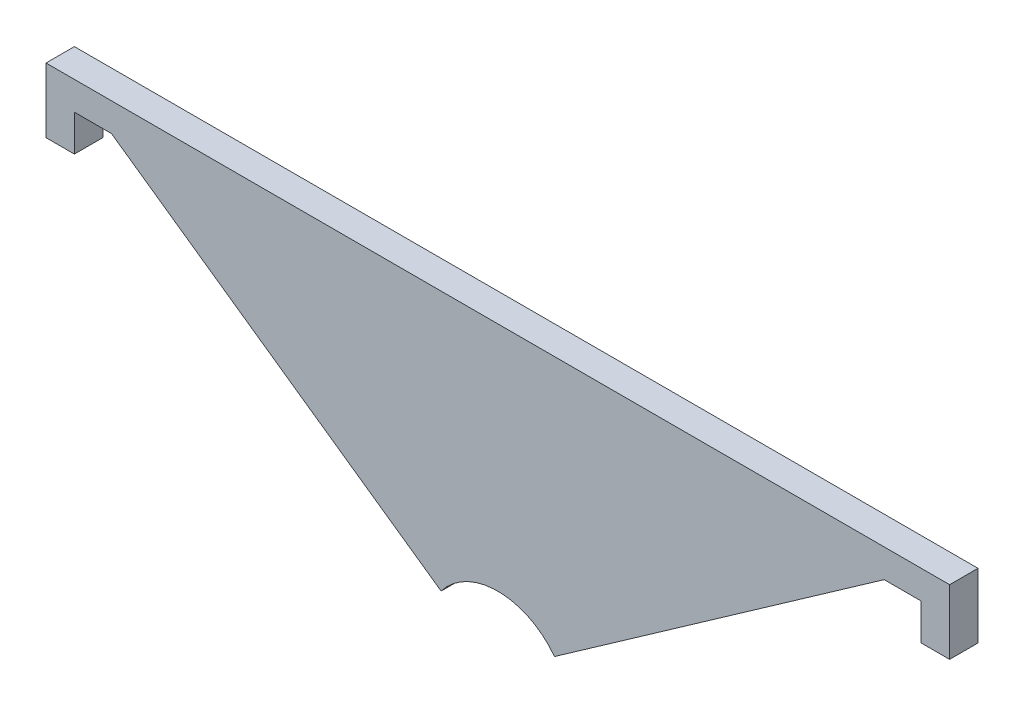
ISO-10303-21;
HEADER;
FILE_DESCRIPTION(('STEP AP214'),'2;1');
FILE_NAME('part.step','',(''),(''),'','','');
FILE_SCHEMA(('AUTOMOTIVE_DESIGN { 1 0 10303 214 1 1 1 1 }'));
ENDSEC;
DATA;
#1=APPLICATION_CONTEXT('core data for automotive mechanical design processes');
#2=APPLICATION_PROTOCOL_DEFINITION('international standard','automotive_design',2000,#1);
#3=PRODUCT_CONTEXT('',#1,'mechanical');
#4=PRODUCT('Part','Part','',(#3));
#5=PRODUCT_RELATED_PRODUCT_CATEGORY('part','',(#4));
#6=PRODUCT_DEFINITION_FORMATION('','',#4);
#7=PRODUCT_DEFINITION_CONTEXT('part definition',#1,'design');
#8=PRODUCT_DEFINITION('design','',#6,#7);
#9=PRODUCT_DEFINITION_SHAPE('','',#8);
#10=(LENGTH_UNIT() NAMED_UNIT(*) SI_UNIT(.MILLI.,.METRE.));
#11=(NAMED_UNIT(*) PLANE_ANGLE_UNIT() SI_UNIT($,.RADIAN.));
#12=(NAMED_UNIT(*) SI_UNIT($,.STERADIAN.) SOLID_ANGLE_UNIT());
#13=UNCERTAINTY_MEASURE_WITH_UNIT(LENGTH_MEASURE(1.E-05),#10,'distance_accuracy_value','');
#14=(GEOMETRIC_REPRESENTATION_CONTEXT(3) GLOBAL_UNCERTAINTY_ASSIGNED_CONTEXT((#13)) GLOBAL_UNIT_ASSIGNED_CONTEXT((#10,
#11,#12)) REPRESENTATION_CONTEXT('',''));
#15=CARTESIAN_POINT('',(0.,0.,0.));
#16=DIRECTION('',(0.,0.,1.));
#17=DIRECTION('',(1.,0.,0.));
#18=AXIS2_PLACEMENT_3D('',#15,#16,#17);
#19=CARTESIAN_POINT('',(-47.75,65.6296073544931,3.));
#20=DIRECTION('',(1.,0.,0.));
#21=DIRECTION('',(0.,0.,-1.));
#22=AXIS2_PLACEMENT_3D('',#19,#20,#21);
#23=PLANE('',#22);
#24=DIRECTION('',(0.,-1.,0.));
#25=VECTOR('',#24,1.);
#26=CARTESIAN_POINT('',(-47.75,65.6296073544931,0.));
#27=LINE('',#26,#25);
#28=CARTESIAN_POINT('',(-47.75,72.4689283735536,0.));
#29=VERTEX_POINT('',#28);
#30=CARTESIAN_POINT('',(-47.75,65.6296073544931,0.));
#31=VERTEX_POINT('',#30);
#32=EDGE_CURVE('E152',#29,#31,#27,.T.);
#33=ORIENTED_EDGE('',*,*,#32,.T.);
#34=DIRECTION('',(0.,0.,-1.));
#35=VECTOR('',#34,1.);
#36=CARTESIAN_POINT('',(-47.75,65.6296073544931,3.));
#37=LINE('',#36,#35);
#38=CARTESIAN_POINT('',(-47.75,65.6296073544931,3.));
#39=VERTEX_POINT('',#38);
#40=EDGE_CURVE('E11',#39,#31,#37,.T.);
#41=ORIENTED_EDGE('',*,*,#40,.F.);
#42=DIRECTION('',(0.,-1.,0.));
#43=VECTOR('',#42,1.);
#44=CARTESIAN_POINT('',(-47.75,65.6296073544931,3.));
#45=LINE('',#44,#43);
#46=CARTESIAN_POINT('',(-47.75,72.4689283735536,3.));
#47=VERTEX_POINT('',#46);
#48=EDGE_CURVE('E174',#47,#39,#45,.T.);
#49=ORIENTED_EDGE('',*,*,#48,.F.);
#50=DIRECTION('',(0.,0.,-1.));
#51=VECTOR('',#50,1.);
#52=CARTESIAN_POINT('',(-47.75,72.4689283735536,3.));
#53=LINE('',#52,#51);
#54=EDGE_CURVE('E148',#47,#29,#53,.T.);
#55=ORIENTED_EDGE('',*,*,#54,.T.);
#56=EDGE_LOOP('',(#33,#41,#49,#55));
#57=FACE_BOUND('',#56,.T.);
#58=ADVANCED_FACE('F32',(#57),#23,.F.);
#59=CARTESIAN_POINT('',(-47.75,65.6296073544931,3.));
#60=DIRECTION('',(0.,1.,0.));
#61=DIRECTION('',(0.,0.,1.));
#62=AXIS2_PLACEMENT_3D('',#59,#60,#61);
#63=PLANE('',#62);
#64=DIRECTION('',(1.,0.,0.));
#65=VECTOR('',#64,1.);
#66=CARTESIAN_POINT('',(-47.75,65.6296073544931,0.));
#67=LINE('',#66,#65);
#68=CARTESIAN_POINT('',(-44.75,65.6296073544931,0.));
#69=VERTEX_POINT('',#68);
#70=EDGE_CURVE('E155',#31,#69,#67,.T.);
#71=ORIENTED_EDGE('',*,*,#70,.T.);
#72=DIRECTION('',(0.,0.,-1.));
#73=VECTOR('',#72,1.);
#74=CARTESIAN_POINT('',(-44.75,65.6296073544931,3.));
#75=LINE('',#74,#73);
#76=CARTESIAN_POINT('',(-44.75,65.6296073544931,3.));
#77=VERTEX_POINT('',#76);
#78=EDGE_CURVE('E40',#77,#69,#75,.T.);
#79=ORIENTED_EDGE('',*,*,#78,.F.);
#80=DIRECTION('',(1.,0.,0.));
#81=VECTOR('',#80,1.);
#82=CARTESIAN_POINT('',(-47.75,65.6296073544931,3.));
#83=LINE('',#82,#81);
#84=EDGE_CURVE('E103',#39,#77,#83,.T.);
#85=ORIENTED_EDGE('',*,*,#84,.F.);
#86=ORIENTED_EDGE('',*,*,#40,.T.);
#87=EDGE_LOOP('',(#71,#79,#85,#86));
#88=FACE_BOUND('',#87,.T.);
#89=ADVANCED_FACE('F252',(#88),#63,.F.);
#90=CARTESIAN_POINT('',(-44.75,65.6296073544931,3.));
#91=DIRECTION('',(-1.,0.,0.));
#92=DIRECTION('',(0.,0.,1.));
#93=AXIS2_PLACEMENT_3D('',#90,#91,#92);
#94=PLANE('',#93);
#95=DIRECTION('',(0.,1.,0.));
#96=VECTOR('',#95,1.);
#97=CARTESIAN_POINT('',(-44.75,65.6296073544931,0.));
#98=LINE('',#97,#96);
#99=CARTESIAN_POINT('',(-44.75,69.4689283735536,0.));
#100=VERTEX_POINT('',#99);
#101=EDGE_CURVE('E157',#69,#100,#98,.T.);
#102=ORIENTED_EDGE('',*,*,#101,.T.);
#103=DIRECTION('',(0.,0.,-1.));
#104=VECTOR('',#103,1.);
#105=CARTESIAN_POINT('',(-44.75,69.4689283735536,3.));
#106=LINE('',#105,#104);
#107=CARTESIAN_POINT('',(-44.75,69.4689283735536,3.));
#108=VERTEX_POINT('',#107);
#109=EDGE_CURVE('E193',#108,#100,#106,.T.);
#110=ORIENTED_EDGE('',*,*,#109,.F.);
#111=DIRECTION('',(0.,1.,0.));
#112=VECTOR('',#111,1.);
#113=CARTESIAN_POINT('',(-44.75,65.6296073544931,3.));
#114=LINE('',#113,#112);
#115=EDGE_CURVE('E201',#77,#108,#114,.T.);
#116=ORIENTED_EDGE('',*,*,#115,.F.);
#117=ORIENTED_EDGE('',*,*,#78,.T.);
#118=EDGE_LOOP('',(#102,#110,#116,#117));
#119=FACE_BOUND('',#118,.T.);
#120=ADVANCED_FACE('F199',(#119),#94,.F.);
#121=CARTESIAN_POINT('',(-44.75,69.4689283735536,3.));
#122=DIRECTION('',(0.,1.,0.));
#123=DIRECTION('',(0.,0.,1.));
#124=AXIS2_PLACEMENT_3D('',#121,#122,#123);
#125=PLANE('',#124);
#126=DIRECTION('',(1.,0.,0.));
#127=VECTOR('',#126,1.);
#128=CARTESIAN_POINT('',(-44.75,69.4689283735536,0.));
#129=LINE('',#128,#127);
#130=CARTESIAN_POINT('',(-40.8316899293085,69.4689283735536,0.));
#131=VERTEX_POINT('',#130);
#132=EDGE_CURVE('E159',#100,#131,#129,.T.);
#133=ORIENTED_EDGE('',*,*,#132,.T.);
#134=DIRECTION('',(0.,0.,-1.));
#135=VECTOR('',#134,1.);
#136=CARTESIAN_POINT('',(-40.8316899293085,69.4689283735536,3.));
#137=LINE('',#136,#135);
#138=CARTESIAN_POINT('',(-40.8316899293085,69.4689283735536,3.));
#139=VERTEX_POINT('',#138);
#140=EDGE_CURVE('E190',#139,#131,#137,.T.);
#141=ORIENTED_EDGE('',*,*,#140,.F.);
#142=DIRECTION('',(1.,0.,0.));
#143=VECTOR('',#142,1.);
#144=CARTESIAN_POINT('',(-44.75,69.4689283735536,3.));
#145=LINE('',#144,#143);
#146=EDGE_CURVE('E219',#108,#139,#145,.T.);
#147=ORIENTED_EDGE('',*,*,#146,.F.);
#148=ORIENTED_EDGE('',*,*,#109,.T.);
#149=EDGE_LOOP('',(#133,#141,#147,#148));
#150=FACE_BOUND('',#149,.T.);
#151=ADVANCED_FACE('F210',(#150),#125,.F.);
#152=CARTESIAN_POINT('',(-40.8316899293085,69.4689283735536,3.));
#153=DIRECTION('',(0.574555500167891,0.818465623729442,0.));
#154=DIRECTION('',(-0.818465623729442,0.574555500167891,0.));
#155=AXIS2_PLACEMENT_3D('',#152,#153,#154);
#156=PLANE('',#155);
#157=DIRECTION('',(0.818465623729442,-0.574555500167891,0.));
#158=VECTOR('',#157,1.);
#159=CARTESIAN_POINT('',(-40.8316899293085,69.4689283735536,0.));
#160=LINE('',#159,#158);
#161=CARTESIAN_POINT('',(-5.99144208167181,45.0113880105764,0.));
#162=VERTEX_POINT('',#161);
#163=EDGE_CURVE('E161',#131,#162,#160,.T.);
#164=ORIENTED_EDGE('',*,*,#163,.T.);
#165=DIRECTION('',(0.,0.,-1.));
#166=VECTOR('',#165,1.);
#167=CARTESIAN_POINT('',(-5.99144208167181,45.0113880105764,3.));
#168=LINE('',#167,#166);
#169=CARTESIAN_POINT('',(-5.99144208167181,45.0113880105764,3.));
#170=VERTEX_POINT('',#169);
#171=EDGE_CURVE('E187',#170,#162,#168,.T.);
#172=ORIENTED_EDGE('',*,*,#171,.F.);
#173=DIRECTION('',(0.818465623729442,-0.574555500167891,0.));
#174=VECTOR('',#173,1.);
#175=CARTESIAN_POINT('',(-40.8316899293085,69.4689283735536,3.));
#176=LINE('',#175,#174);
#177=EDGE_CURVE('E216',#139,#170,#176,.T.);
#178=ORIENTED_EDGE('',*,*,#177,.F.);
#179=ORIENTED_EDGE('',*,*,#140,.T.);
#180=EDGE_LOOP('',(#164,#172,#178,#179));
#181=FACE_BOUND('',#180,.T.);
#182=ADVANCED_FACE('F214',(#181),#156,.F.);
#183=CARTESIAN_POINT('',(0.,40.5,3.));
#184=DIRECTION('',(0.,0.,-1.));
#185=DIRECTION('',(-1.,0.,0.));
#186=AXIS2_PLACEMENT_3D('',#183,#184,#185);
#187=CYLINDRICAL_SURFACE('',#186,7.5);
#188=CARTESIAN_POINT('',(0.,40.5,0.));
#189=DIRECTION('',(0.,0.,-1.));
#190=DIRECTION('',(1.,0.,0.));
#191=AXIS2_PLACEMENT_3D('',#188,#189,#190);
#192=CIRCLE('',#191,7.5);
#193=CARTESIAN_POINT('',(5.99144208167181,45.0113880105764,0.));
#194=VERTEX_POINT('',#193);
#195=EDGE_CURVE('E163',#162,#194,#192,.T.);
#196=ORIENTED_EDGE('',*,*,#195,.T.);
#197=DIRECTION('',(0.,0.,-1.));
#198=VECTOR('',#197,1.);
#199=CARTESIAN_POINT('',(5.99144208167181,45.0113880105764,3.));
#200=LINE('',#199,#198);
#201=CARTESIAN_POINT('',(5.99144208167181,45.0113880105764,3.));
#202=VERTEX_POINT('',#201);
#203=EDGE_CURVE('E184',#202,#194,#200,.T.);
#204=ORIENTED_EDGE('',*,*,#203,.F.);
#205=CARTESIAN_POINT('',(0.,40.5,3.));
#206=DIRECTION('',(0.,0.,-1.));
#207=DIRECTION('',(1.,0.,0.));
#208=AXIS2_PLACEMENT_3D('',#205,#206,#207);
#209=CIRCLE('',#208,7.5);
#210=EDGE_CURVE('E218',#170,#202,#209,.T.);
#211=ORIENTED_EDGE('',*,*,#210,.F.);
#212=ORIENTED_EDGE('',*,*,#171,.T.);
#213=EDGE_LOOP('',(#196,#204,#211,#212));
#214=FACE_BOUND('',#213,.T.);
#215=ADVANCED_FACE('F265',(#214),#187,.F.);
#216=CARTESIAN_POINT('',(40.8316899293085,69.4689283735536,3.));
#217=DIRECTION('',(-0.574555500167891,0.818465623729442,0.));
#218=DIRECTION('',(-0.818465623729442,-0.574555500167891,0.));
#219=AXIS2_PLACEMENT_3D('',#216,#217,#218);
#220=PLANE('',#219);
#221=DIRECTION('',(0.818465623729442,0.574555500167891,0.));
#222=VECTOR('',#221,1.);
#223=CARTESIAN_POINT('',(40.8316899293085,69.4689283735536,0.));
#224=LINE('',#223,#222);
#225=CARTESIAN_POINT('',(40.8316899293085,69.4689283735536,0.));
#226=VERTEX_POINT('',#225);
#227=EDGE_CURVE('E165',#194,#226,#224,.T.);
#228=ORIENTED_EDGE('',*,*,#227,.T.);
#229=DIRECTION('',(0.,0.,-1.));
#230=VECTOR('',#229,1.);
#231=CARTESIAN_POINT('',(40.8316899293085,69.4689283735536,3.));
#232=LINE('',#231,#230);
#233=CARTESIAN_POINT('',(40.8316899293085,69.4689283735536,3.));
#234=VERTEX_POINT('',#233);
#235=EDGE_CURVE('E181',#234,#226,#232,.T.);
#236=ORIENTED_EDGE('',*,*,#235,.F.);
#237=DIRECTION('',(0.818465623729442,0.574555500167891,0.));
#238=VECTOR('',#237,1.);
#239=CARTESIAN_POINT('',(40.8316899293085,69.4689283735536,3.));
#240=LINE('',#239,#238);
#241=EDGE_CURVE('E221',#202,#234,#240,.T.);
#242=ORIENTED_EDGE('',*,*,#241,.F.);
#243=ORIENTED_EDGE('',*,*,#203,.T.);
#244=EDGE_LOOP('',(#228,#236,#242,#243));
#245=FACE_BOUND('',#244,.T.);
#246=ADVANCED_FACE('F268',(#245),#220,.F.);
#247=CARTESIAN_POINT('',(44.75,69.4689283735536,3.));
#248=DIRECTION('',(0.,1.,0.));
#249=DIRECTION('',(0.,0.,1.));
#250=AXIS2_PLACEMENT_3D('',#247,#248,#249);
#251=PLANE('',#250);
#252=DIRECTION('',(1.,0.,0.));
#253=VECTOR('',#252,1.);
#254=CARTESIAN_POINT('',(44.75,69.4689283735536,0.));
#255=LINE('',#254,#253);
#256=CARTESIAN_POINT('',(44.75,69.4689283735536,0.));
#257=VERTEX_POINT('',#256);
#258=EDGE_CURVE('E167',#226,#257,#255,.T.);
#259=ORIENTED_EDGE('',*,*,#258,.T.);
#260=DIRECTION('',(0.,0.,-1.));
#261=VECTOR('',#260,1.);
#262=CARTESIAN_POINT('',(44.75,69.4689283735536,3.));
#263=LINE('',#262,#261);
#264=CARTESIAN_POINT('',(44.75,69.4689283735536,3.));
#265=VERTEX_POINT('',#264);
#266=EDGE_CURVE('E178',#265,#257,#263,.T.);
#267=ORIENTED_EDGE('',*,*,#266,.F.);
#268=DIRECTION('',(1.,0.,0.));
#269=VECTOR('',#268,1.);
#270=CARTESIAN_POINT('',(44.75,69.4689283735536,3.));
#271=LINE('',#270,#269);
#272=EDGE_CURVE('E227',#234,#265,#271,.T.);
#273=ORIENTED_EDGE('',*,*,#272,.F.);
#274=ORIENTED_EDGE('',*,*,#235,.T.);
#275=EDGE_LOOP('',(#259,#267,#273,#274));
#276=FACE_BOUND('',#275,.T.);
#277=ADVANCED_FACE('F233',(#276),#251,.F.);
#278=CARTESIAN_POINT('',(44.75,65.6296073544931,3.));
#279=DIRECTION('',(1.,0.,0.));
#280=DIRECTION('',(0.,0.,-1.));
#281=AXIS2_PLACEMENT_3D('',#278,#279,#280);
#282=PLANE('',#281);
#283=DIRECTION('',(0.,-1.,0.));
#284=VECTOR('',#283,1.);
#285=CARTESIAN_POINT('',(44.75,65.6296073544931,0.));
#286=LINE('',#285,#284);
#287=CARTESIAN_POINT('',(44.75,65.6296073544931,0.));
#288=VERTEX_POINT('',#287);
#289=EDGE_CURVE('E169',#257,#288,#286,.T.);
#290=ORIENTED_EDGE('',*,*,#289,.T.);
#291=DIRECTION('',(0.,0.,-1.));
#292=VECTOR('',#291,1.);
#293=CARTESIAN_POINT('',(44.75,65.6296073544931,3.));
#294=LINE('',#293,#292);
#295=CARTESIAN_POINT('',(44.75,65.6296073544931,3.));
#296=VERTEX_POINT('',#295);
#297=EDGE_CURVE('E143',#296,#288,#294,.T.);
#298=ORIENTED_EDGE('',*,*,#297,.F.);
#299=DIRECTION('',(0.,-1.,0.));
#300=VECTOR('',#299,1.);
#301=CARTESIAN_POINT('',(44.75,65.6296073544931,3.));
#302=LINE('',#301,#300);
#303=EDGE_CURVE('E134',#265,#296,#302,.T.);
#304=ORIENTED_EDGE('',*,*,#303,.F.);
#305=ORIENTED_EDGE('',*,*,#266,.T.);
#306=EDGE_LOOP('',(#290,#298,#304,#305));
#307=FACE_BOUND('',#306,.T.);
#308=ADVANCED_FACE('F237',(#307),#282,.F.);
#309=CARTESIAN_POINT('',(47.75,65.6296073544931,3.));
#310=DIRECTION('',(0.,1.,0.));
#311=DIRECTION('',(0.,0.,1.));
#312=AXIS2_PLACEMENT_3D('',#309,#310,#311);
#313=PLANE('',#312);
#314=DIRECTION('',(1.,0.,0.));
#315=VECTOR('',#314,1.);
#316=CARTESIAN_POINT('',(47.75,65.6296073544931,0.));
#317=LINE('',#316,#315);
#318=CARTESIAN_POINT('',(47.75,65.6296073544931,0.));
#319=VERTEX_POINT('',#318);
#320=EDGE_CURVE('E142',#288,#319,#317,.T.);
#321=ORIENTED_EDGE('',*,*,#320,.T.);
#322=DIRECTION('',(0.,0.,-1.));
#323=VECTOR('',#322,1.);
#324=CARTESIAN_POINT('',(47.75,65.6296073544931,3.));
#325=LINE('',#324,#323);
#326=CARTESIAN_POINT('',(47.75,65.6296073544931,3.));
#327=VERTEX_POINT('',#326);
#328=EDGE_CURVE('E139',#327,#319,#325,.T.);
#329=ORIENTED_EDGE('',*,*,#328,.F.);
#330=DIRECTION('',(1.,0.,0.));
#331=VECTOR('',#330,1.);
#332=CARTESIAN_POINT('',(47.75,65.6296073544931,3.));
#333=LINE('',#332,#331);
#334=EDGE_CURVE('E128',#296,#327,#333,.T.);
#335=ORIENTED_EDGE('',*,*,#334,.F.);
#336=ORIENTED_EDGE('',*,*,#297,.T.);
#337=EDGE_LOOP('',(#321,#329,#335,#336));
#338=FACE_BOUND('',#337,.T.);
#339=ADVANCED_FACE('F140',(#338),#313,.F.);
#340=CARTESIAN_POINT('',(47.75,65.6296073544931,3.));
#341=DIRECTION('',(-1.,0.,0.));
#342=DIRECTION('',(0.,0.,1.));
#343=AXIS2_PLACEMENT_3D('',#340,#341,#342);
#344=PLANE('',#343);
#345=DIRECTION('',(0.,1.,0.));
#346=VECTOR('',#345,1.);
#347=CARTESIAN_POINT('',(47.75,65.6296073544931,0.));
#348=LINE('',#347,#346);
#349=CARTESIAN_POINT('',(47.75,72.4689283735536,0.));
#350=VERTEX_POINT('',#349);
#351=EDGE_CURVE('E89',#319,#350,#348,.T.);
#352=ORIENTED_EDGE('',*,*,#351,.T.);
#353=DIRECTION('',(0.,0.,-1.));
#354=VECTOR('',#353,1.);
#355=CARTESIAN_POINT('',(47.75,72.4689283735536,3.));
#356=LINE('',#355,#354);
#357=CARTESIAN_POINT('',(47.75,72.4689283735536,3.));
#358=VERTEX_POINT('',#357);
#359=EDGE_CURVE('E144',#358,#350,#356,.T.);
#360=ORIENTED_EDGE('',*,*,#359,.F.);
#361=DIRECTION('',(0.,1.,0.));
#362=VECTOR('',#361,1.);
#363=CARTESIAN_POINT('',(47.75,65.6296073544931,3.));
#364=LINE('',#363,#362);
#365=EDGE_CURVE('E132',#327,#358,#364,.T.);
#366=ORIENTED_EDGE('',*,*,#365,.F.);
#367=ORIENTED_EDGE('',*,*,#328,.T.);
#368=EDGE_LOOP('',(#352,#360,#366,#367));
#369=FACE_BOUND('',#368,.T.);
#370=ADVANCED_FACE('F146',(#369),#344,.F.);
#371=CARTESIAN_POINT('',(47.75,72.4689283735536,3.));
#372=DIRECTION('',(0.,-1.,0.));
#373=DIRECTION('',(0.,0.,-1.));
#374=AXIS2_PLACEMENT_3D('',#371,#372,#373);
#375=PLANE('',#374);
#376=DIRECTION('',(-1.,0.,0.));
#377=VECTOR('',#376,1.);
#378=CARTESIAN_POINT('',(47.75,72.4689283735536,0.));
#379=LINE('',#378,#377);
#380=EDGE_CURVE('E95',#350,#29,#379,.T.);
#381=ORIENTED_EDGE('',*,*,#380,.T.);
#382=ORIENTED_EDGE('',*,*,#54,.F.);
#383=DIRECTION('',(-1.,0.,0.));
#384=VECTOR('',#383,1.);
#385=CARTESIAN_POINT('',(47.75,72.4689283735536,3.));
#386=LINE('',#385,#384);
#387=EDGE_CURVE('E48',#358,#47,#386,.T.);
#388=ORIENTED_EDGE('',*,*,#387,.F.);
#389=ORIENTED_EDGE('',*,*,#359,.T.);
#390=EDGE_LOOP('',(#381,#382,#388,#389));
#391=FACE_BOUND('',#390,.T.);
#392=ADVANCED_FACE('F241',(#391),#375,.F.);
#393=CARTESIAN_POINT('',(0.,40.5,3.));
#394=DIRECTION('',(0.,0.,1.));
#395=DIRECTION('',(1.,0.,0.));
#396=AXIS2_PLACEMENT_3D('',#393,#394,#395);
#397=PLANE('',#396);
#398=ORIENTED_EDGE('',*,*,#48,.T.);
#399=ORIENTED_EDGE('',*,*,#84,.T.);
#400=ORIENTED_EDGE('',*,*,#115,.T.);
#401=ORIENTED_EDGE('',*,*,#146,.T.);
#402=ORIENTED_EDGE('',*,*,#177,.T.);
#403=ORIENTED_EDGE('',*,*,#210,.T.);
#404=ORIENTED_EDGE('',*,*,#241,.T.);
#405=ORIENTED_EDGE('',*,*,#272,.T.);
#406=ORIENTED_EDGE('',*,*,#303,.T.);
#407=ORIENTED_EDGE('',*,*,#334,.T.);
#408=ORIENTED_EDGE('',*,*,#365,.T.);
#409=ORIENTED_EDGE('',*,*,#387,.T.);
#410=EDGE_LOOP('',(#398,#399,#400,#401,#402,#403,#404,#405,#406,#407,#408,#409));
#411=FACE_BOUND('',#410,.T.);
#412=ADVANCED_FACE('F130',(#411),#397,.T.);
#413=CARTESIAN_POINT('',(0.,40.5,0.));
#414=DIRECTION('',(0.,0.,1.));
#415=DIRECTION('',(1.,0.,0.));
#416=AXIS2_PLACEMENT_3D('',#413,#414,#415);
#417=PLANE('',#416);
#418=ORIENTED_EDGE('',*,*,#32,.F.);
#419=ORIENTED_EDGE('',*,*,#380,.F.);
#420=ORIENTED_EDGE('',*,*,#351,.F.);
#421=ORIENTED_EDGE('',*,*,#320,.F.);
#422=ORIENTED_EDGE('',*,*,#289,.F.);
#423=ORIENTED_EDGE('',*,*,#258,.F.);
#424=ORIENTED_EDGE('',*,*,#227,.F.);
#425=ORIENTED_EDGE('',*,*,#195,.F.);
#426=ORIENTED_EDGE('',*,*,#163,.F.);
#427=ORIENTED_EDGE('',*,*,#132,.F.);
#428=ORIENTED_EDGE('',*,*,#101,.F.);
#429=ORIENTED_EDGE('',*,*,#70,.F.);
#430=EDGE_LOOP('',(#418,#419,#420,#421,#422,#423,#424,#425,#426,#427,#428,#429));
#431=FACE_BOUND('',#430,.T.);
#432=ADVANCED_FACE('F205',(#431),#417,.F.);
#433=CLOSED_SHELL('',(#58,#89,#120,#151,#182,#215,#246,#277,#308,#339,#370,#392,#412,#432));
#434=MANIFOLD_SOLID_BREP('B2',#433);
#435=ADVANCED_BREP_SHAPE_REPRESENTATION('',(#18,#434),#14);
#436=SHAPE_DEFINITION_REPRESENTATION(#9,#435);
ENDSEC;
END-ISO-10303-21;
